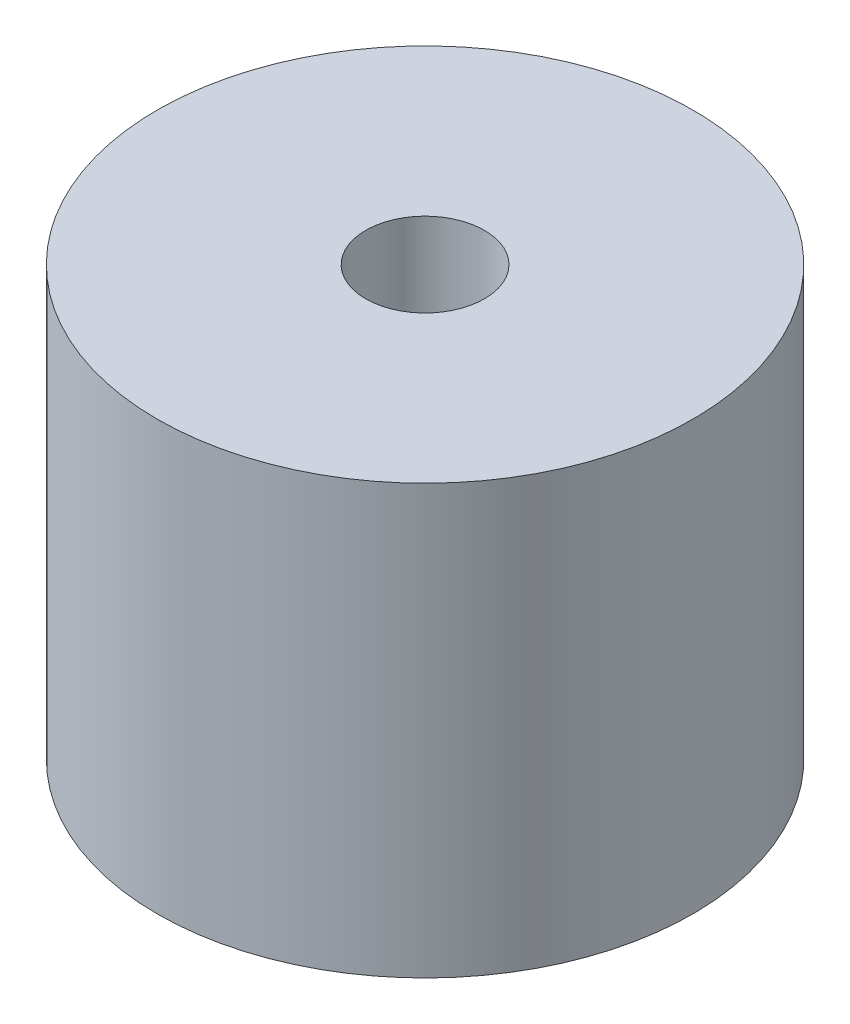
ISO-10303-21;
HEADER;
FILE_DESCRIPTION(('STEP AP214'),'2;1');
FILE_NAME('part.step','',(''),(''),'','','');
FILE_SCHEMA(('AUTOMOTIVE_DESIGN { 1 0 10303 214 1 1 1 1 }'));
ENDSEC;
DATA;
#1=APPLICATION_CONTEXT('core data for automotive mechanical design processes');
#2=APPLICATION_PROTOCOL_DEFINITION('international standard','automotive_design',2000,#1);
#3=PRODUCT_CONTEXT('',#1,'mechanical');
#4=PRODUCT('Part','Part','',(#3));
#5=PRODUCT_RELATED_PRODUCT_CATEGORY('part','',(#4));
#6=PRODUCT_DEFINITION_FORMATION('','',#4);
#7=PRODUCT_DEFINITION_CONTEXT('part definition',#1,'design');
#8=PRODUCT_DEFINITION('design','',#6,#7);
#9=PRODUCT_DEFINITION_SHAPE('','',#8);
#10=(LENGTH_UNIT() NAMED_UNIT(*) SI_UNIT(.MILLI.,.METRE.));
#11=(NAMED_UNIT(*) PLANE_ANGLE_UNIT() SI_UNIT($,.RADIAN.));
#12=(NAMED_UNIT(*) SI_UNIT($,.STERADIAN.) SOLID_ANGLE_UNIT());
#13=UNCERTAINTY_MEASURE_WITH_UNIT(LENGTH_MEASURE(1.E-05),#10,'distance_accuracy_value','');
#14=(GEOMETRIC_REPRESENTATION_CONTEXT(3) GLOBAL_UNCERTAINTY_ASSIGNED_CONTEXT((#13)) GLOBAL_UNIT_ASSIGNED_CONTEXT((#10,
#11,#12)) REPRESENTATION_CONTEXT('',''));
#15=CARTESIAN_POINT('',(0.,0.,0.));
#16=DIRECTION('',(0.,0.,1.));
#17=DIRECTION('',(1.,0.,0.));
#18=AXIS2_PLACEMENT_3D('',#15,#16,#17);
#19=CARTESIAN_POINT('',(0.,9.6,0.));
#20=DIRECTION('',(0.,-1.,0.));
#21=DIRECTION('',(0.,0.,-1.));
#22=AXIS2_PLACEMENT_3D('',#19,#20,#21);
#23=CYLINDRICAL_SURFACE('',#22,6.);
#24=CARTESIAN_POINT('',(0.,9.6,0.));
#25=DIRECTION('',(0.,1.,0.));
#26=DIRECTION('',(0.,0.,1.));
#27=AXIS2_PLACEMENT_3D('',#24,#25,#26);
#28=CIRCLE('',#27,6.);
#29=CARTESIAN_POINT('',(0.,9.6,6.));
#30=VERTEX_POINT('',#29);
#31=EDGE_CURVE('E50',#30,#30,#28,.T.);
#32=ORIENTED_EDGE('',*,*,#31,.F.);
#33=EDGE_LOOP('',(#32));
#34=FACE_BOUND('',#33,.T.);
#35=CARTESIAN_POINT('',(0.,0.,0.));
#36=DIRECTION('',(0.,1.,0.));
#37=DIRECTION('',(0.,0.,1.));
#38=AXIS2_PLACEMENT_3D('',#35,#36,#37);
#39=CIRCLE('',#38,6.);
#40=CARTESIAN_POINT('',(0.,0.,6.));
#41=VERTEX_POINT('',#40);
#42=EDGE_CURVE('E57',#41,#41,#39,.T.);
#43=ORIENTED_EDGE('',*,*,#42,.T.);
#44=EDGE_LOOP('',(#43));
#45=FACE_BOUND('',#44,.T.);
#46=ADVANCED_FACE('F36',(#34,#45),#23,.T.);
#47=CARTESIAN_POINT('',(0.,9.6,0.));
#48=DIRECTION('',(0.,1.,0.));
#49=DIRECTION('',(0.,0.,1.));
#50=AXIS2_PLACEMENT_3D('',#47,#48,#49);
#51=PLANE('',#50);
#52=CARTESIAN_POINT('',(0.,9.6,0.));
#53=DIRECTION('',(0.,1.,0.));
#54=DIRECTION('',(0.,0.,1.));
#55=AXIS2_PLACEMENT_3D('',#52,#53,#54);
#56=CIRCLE('',#55,1.33);
#57=CARTESIAN_POINT('',(0.,9.6,1.33));
#58=VERTEX_POINT('',#57);
#59=EDGE_CURVE('E63',#58,#58,#56,.T.);
#60=ORIENTED_EDGE('',*,*,#59,.F.);
#61=EDGE_LOOP('',(#60));
#62=FACE_BOUND('',#61,.T.);
#63=ORIENTED_EDGE('',*,*,#31,.T.);
#64=EDGE_LOOP('',(#63));
#65=FACE_BOUND('',#64,.T.);
#66=ADVANCED_FACE('F97',(#62,#65),#51,.T.);
#67=CARTESIAN_POINT('',(0.,0.,0.));
#68=DIRECTION('',(0.,1.,0.));
#69=DIRECTION('',(0.,0.,1.));
#70=AXIS2_PLACEMENT_3D('',#67,#68,#69);
#71=PLANE('',#70);
#72=CARTESIAN_POINT('',(3.75,0.,0.));
#73=DIRECTION('',(0.,1.,0.));
#74=DIRECTION('',(0.,0.,1.));
#75=AXIS2_PLACEMENT_3D('',#72,#73,#74);
#76=CIRCLE('',#75,0.3);
#77=CARTESIAN_POINT('',(3.75,0.,0.300000000000004));
#78=VERTEX_POINT('',#77);
#79=EDGE_CURVE('E10',#78,#78,#76,.F.);
#80=ORIENTED_EDGE('',*,*,#79,.F.);
#81=EDGE_LOOP('',(#80));
#82=FACE_BOUND('',#81,.T.);
#83=CARTESIAN_POINT('',(-3.75,0.,0.));
#84=DIRECTION('',(0.,1.,0.));
#85=DIRECTION('',(0.,0.,1.));
#86=AXIS2_PLACEMENT_3D('',#83,#84,#85);
#87=CIRCLE('',#86,0.3);
#88=CARTESIAN_POINT('',(-3.75,0.,0.3));
#89=VERTEX_POINT('',#88);
#90=EDGE_CURVE('E43',#89,#89,#87,.F.);
#91=ORIENTED_EDGE('',*,*,#90,.F.);
#92=EDGE_LOOP('',(#91));
#93=FACE_BOUND('',#92,.T.);
#94=ORIENTED_EDGE('',*,*,#42,.F.);
#95=EDGE_LOOP('',(#94));
#96=FACE_BOUND('',#95,.T.);
#97=ADVANCED_FACE('F102',(#82,#93,#96),#71,.F.);
#98=CARTESIAN_POINT('',(0.,6.6,0.));
#99=DIRECTION('',(0.,1.,0.));
#100=DIRECTION('',(0.,0.,1.));
#101=AXIS2_PLACEMENT_3D('',#98,#99,#100);
#102=CYLINDRICAL_SURFACE('',#101,1.33);
#103=CARTESIAN_POINT('',(0.,7.6,0.));
#104=DIRECTION('',(0.,1.,0.));
#105=DIRECTION('',(0.,0.,1.));
#106=AXIS2_PLACEMENT_3D('',#103,#104,#105);
#107=CIRCLE('',#106,1.33);
#108=CARTESIAN_POINT('',(0.,7.6,1.33));
#109=VERTEX_POINT('',#108);
#110=EDGE_CURVE('E60',#109,#109,#107,.F.);
#111=ORIENTED_EDGE('',*,*,#110,.T.);
#112=EDGE_LOOP('',(#111));
#113=FACE_BOUND('',#112,.T.);
#114=ORIENTED_EDGE('',*,*,#59,.T.);
#115=EDGE_LOOP('',(#114));
#116=FACE_BOUND('',#115,.T.);
#117=ADVANCED_FACE('F110',(#113,#116),#102,.F.);
#118=CARTESIAN_POINT('',(0.,7.6,0.));
#119=DIRECTION('',(0.,1.,0.));
#120=DIRECTION('',(0.,0.,1.));
#121=AXIS2_PLACEMENT_3D('',#118,#119,#120);
#122=PLANE('',#121);
#123=CARTESIAN_POINT('',(0.,7.6,0.));
#124=DIRECTION('',(0.,1.,0.));
#125=DIRECTION('',(0.,0.,1.));
#126=AXIS2_PLACEMENT_3D('',#123,#124,#125);
#127=CIRCLE('',#126,5.);
#128=CARTESIAN_POINT('',(0.,7.6,5.));
#129=VERTEX_POINT('',#128);
#130=EDGE_CURVE('E64',#129,#129,#127,.T.);
#131=ORIENTED_EDGE('',*,*,#130,.F.);
#132=EDGE_LOOP('',(#131));
#133=FACE_BOUND('',#132,.T.);
#134=ORIENTED_EDGE('',*,*,#110,.F.);
#135=EDGE_LOOP('',(#134));
#136=FACE_BOUND('',#135,.T.);
#137=ADVANCED_FACE('F115',(#133,#136),#122,.F.);
#138=CARTESIAN_POINT('',(0.,7.6,0.));
#139=DIRECTION('',(0.,-1.,0.));
#140=DIRECTION('',(0.,0.,-1.));
#141=AXIS2_PLACEMENT_3D('',#138,#139,#140);
#142=CYLINDRICAL_SURFACE('',#141,5.);
#143=ORIENTED_EDGE('',*,*,#130,.T.);
#144=EDGE_LOOP('',(#143));
#145=FACE_BOUND('',#144,.T.);
#146=CARTESIAN_POINT('',(0.,6.6,0.));
#147=DIRECTION('',(0.,1.,0.));
#148=DIRECTION('',(0.,0.,1.));
#149=AXIS2_PLACEMENT_3D('',#146,#147,#148);
#150=CIRCLE('',#149,5.);
#151=CARTESIAN_POINT('',(0.,6.6,5.));
#152=VERTEX_POINT('',#151);
#153=EDGE_CURVE('E69',#152,#152,#150,.T.);
#154=ORIENTED_EDGE('',*,*,#153,.F.);
#155=EDGE_LOOP('',(#154));
#156=FACE_BOUND('',#155,.T.);
#157=ADVANCED_FACE('F123',(#145,#156),#142,.F.);
#158=CARTESIAN_POINT('',(0.,6.6,0.));
#159=DIRECTION('',(0.,1.,0.));
#160=DIRECTION('',(0.,0.,1.));
#161=AXIS2_PLACEMENT_3D('',#158,#159,#160);
#162=PLANE('',#161);
#163=ORIENTED_EDGE('',*,*,#153,.T.);
#164=EDGE_LOOP('',(#163));
#165=FACE_BOUND('',#164,.T.);
#166=ADVANCED_FACE('F120',(#165),#162,.T.);
#167=CARTESIAN_POINT('',(-3.75,-1.,0.));
#168=DIRECTION('',(0.,1.,0.));
#169=DIRECTION('',(0.,0.,1.));
#170=AXIS2_PLACEMENT_3D('',#167,#168,#169);
#171=CYLINDRICAL_SURFACE('',#170,0.3);
#172=CARTESIAN_POINT('',(-3.75,-1.,0.));
#173=DIRECTION('',(0.,-1.,0.));
#174=DIRECTION('',(0.,0.,-1.));
#175=AXIS2_PLACEMENT_3D('',#172,#173,#174);
#176=CIRCLE('',#175,0.3);
#177=CARTESIAN_POINT('',(-3.75,-1.,-0.3));
#178=VERTEX_POINT('',#177);
#179=EDGE_CURVE('E72',#178,#178,#176,.T.);
#180=ORIENTED_EDGE('',*,*,#179,.F.);
#181=EDGE_LOOP('',(#180));
#182=FACE_BOUND('',#181,.T.);
#183=ORIENTED_EDGE('',*,*,#90,.T.);
#184=EDGE_LOOP('',(#183));
#185=FACE_BOUND('',#184,.T.);
#186=ADVANCED_FACE('F93',(#182,#185),#171,.T.);
#187=CARTESIAN_POINT('',(-3.75,-1.,0.));
#188=DIRECTION('',(0.,-1.,0.));
#189=DIRECTION('',(0.,0.,-1.));
#190=AXIS2_PLACEMENT_3D('',#187,#188,#189);
#191=PLANE('',#190);
#192=ORIENTED_EDGE('',*,*,#179,.T.);
#193=EDGE_LOOP('',(#192));
#194=FACE_BOUND('',#193,.T.);
#195=ADVANCED_FACE('F86',(#194),#191,.T.);
#196=CARTESIAN_POINT('',(3.75,-1.,0.));
#197=DIRECTION('',(0.,1.,0.));
#198=DIRECTION('',(0.,0.,1.));
#199=AXIS2_PLACEMENT_3D('',#196,#197,#198);
#200=CYLINDRICAL_SURFACE('',#199,0.3);
#201=CARTESIAN_POINT('',(3.75,-1.,0.));
#202=DIRECTION('',(0.,-1.,0.));
#203=DIRECTION('',(0.,0.,1.));
#204=AXIS2_PLACEMENT_3D('',#201,#202,#203);
#205=CIRCLE('',#204,0.3);
#206=CARTESIAN_POINT('',(3.75,-1.,0.300000000000004));
#207=VERTEX_POINT('',#206);
#208=EDGE_CURVE('E78',#207,#207,#205,.T.);
#209=ORIENTED_EDGE('',*,*,#208,.F.);
#210=EDGE_LOOP('',(#209));
#211=FACE_BOUND('',#210,.T.);
#212=ORIENTED_EDGE('',*,*,#79,.T.);
#213=EDGE_LOOP('',(#212));
#214=FACE_BOUND('',#213,.T.);
#215=ADVANCED_FACE('F84',(#211,#214),#200,.T.);
#216=CARTESIAN_POINT('',(3.75,-1.,0.));
#217=DIRECTION('',(0.,1.,0.));
#218=DIRECTION('',(0.,0.,1.));
#219=AXIS2_PLACEMENT_3D('',#216,#217,#218);
#220=PLANE('',#219);
#221=ORIENTED_EDGE('',*,*,#208,.T.);
#222=EDGE_LOOP('',(#221));
#223=FACE_BOUND('',#222,.T.);
#224=ADVANCED_FACE('F82',(#223),#220,.F.);
#225=CLOSED_SHELL('',(#46,#66,#97,#117,#137,#157,#166,#186,#195,#215,#224));
#226=MANIFOLD_SOLID_BREP('B2',#225);
#227=ADVANCED_BREP_SHAPE_REPRESENTATION('',(#18,#226),#14);
#228=SHAPE_DEFINITION_REPRESENTATION(#9,#227);
ENDSEC;
END-ISO-10303-21;
